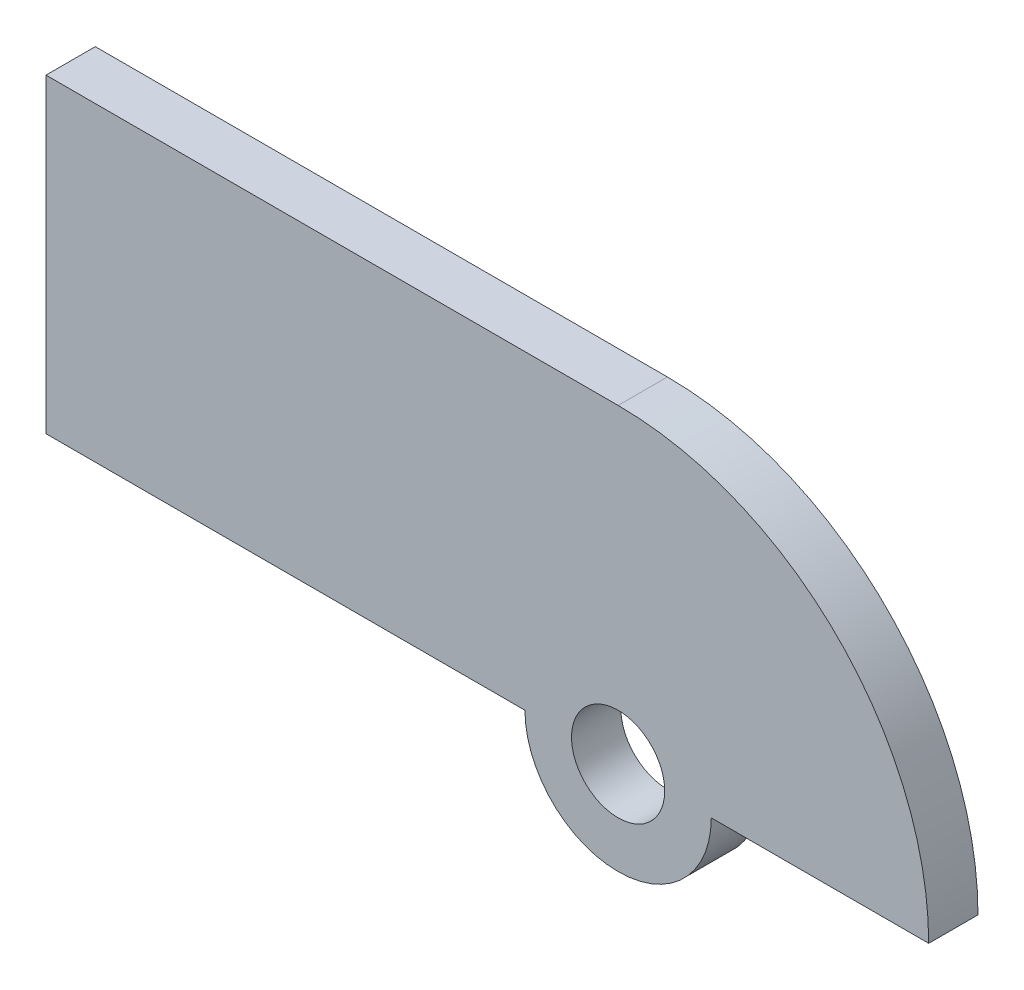
ISO-10303-21;
HEADER;
FILE_DESCRIPTION(('STEP AP214'),'2;1');
FILE_NAME('part.step','',(''),(''),'','','');
FILE_SCHEMA(('AUTOMOTIVE_DESIGN { 1 0 10303 214 1 1 1 1 }'));
ENDSEC;
DATA;
#1=APPLICATION_CONTEXT('core data for automotive mechanical design processes');
#2=APPLICATION_PROTOCOL_DEFINITION('international standard','automotive_design',2000,#1);
#3=PRODUCT_CONTEXT('',#1,'mechanical');
#4=PRODUCT('Part','Part','',(#3));
#5=PRODUCT_RELATED_PRODUCT_CATEGORY('part','',(#4));
#6=PRODUCT_DEFINITION_FORMATION('','',#4);
#7=PRODUCT_DEFINITION_CONTEXT('part definition',#1,'design');
#8=PRODUCT_DEFINITION('design','',#6,#7);
#9=PRODUCT_DEFINITION_SHAPE('','',#8);
#10=(LENGTH_UNIT() NAMED_UNIT(*) SI_UNIT(.MILLI.,.METRE.));
#11=(NAMED_UNIT(*) PLANE_ANGLE_UNIT() SI_UNIT($,.RADIAN.));
#12=(NAMED_UNIT(*) SI_UNIT($,.STERADIAN.) SOLID_ANGLE_UNIT());
#13=UNCERTAINTY_MEASURE_WITH_UNIT(LENGTH_MEASURE(1.E-05),#10,'distance_accuracy_value','');
#14=(GEOMETRIC_REPRESENTATION_CONTEXT(3) GLOBAL_UNCERTAINTY_ASSIGNED_CONTEXT((#13)) GLOBAL_UNIT_ASSIGNED_CONTEXT((#10,
#11,#12)) REPRESENTATION_CONTEXT('',''));
#15=CARTESIAN_POINT('',(0.,0.,0.));
#16=DIRECTION('',(0.,0.,1.));
#17=DIRECTION('',(1.,0.,0.));
#18=AXIS2_PLACEMENT_3D('',#15,#16,#17);
#19=CARTESIAN_POINT('',(0.,0.,3.175));
#20=DIRECTION('',(0.,0.,-1.));
#21=DIRECTION('',(-1.,0.,0.));
#22=AXIS2_PLACEMENT_3D('',#19,#20,#21);
#23=CYLINDRICAL_SURFACE('',#22,6.);
#24=CARTESIAN_POINT('',(0.,0.,0.));
#25=DIRECTION('',(0.,0.,1.));
#26=DIRECTION('',(1.,0.,0.));
#27=AXIS2_PLACEMENT_3D('',#24,#25,#26);
#28=CIRCLE('',#27,6.);
#29=CARTESIAN_POINT('',(-6.,0.,0.));
#30=VERTEX_POINT('',#29);
#31=CARTESIAN_POINT('',(6.,0.,0.));
#32=VERTEX_POINT('',#31);
#33=EDGE_CURVE('E136',#30,#32,#28,.T.);
#34=ORIENTED_EDGE('',*,*,#33,.T.);
#35=DIRECTION('',(0.,0.,-1.));
#36=VECTOR('',#35,1.);
#37=CARTESIAN_POINT('',(6.,0.,3.175));
#38=LINE('',#37,#36);
#39=CARTESIAN_POINT('',(6.,0.,3.175));
#40=VERTEX_POINT('',#39);
#41=EDGE_CURVE('E11',#40,#32,#38,.T.);
#42=ORIENTED_EDGE('',*,*,#41,.F.);
#43=CARTESIAN_POINT('',(0.,0.,3.175));
#44=DIRECTION('',(0.,0.,1.));
#45=DIRECTION('',(1.,0.,0.));
#46=AXIS2_PLACEMENT_3D('',#43,#44,#45);
#47=CIRCLE('',#46,6.);
#48=CARTESIAN_POINT('',(-6.,0.,3.175));
#49=VERTEX_POINT('',#48);
#50=EDGE_CURVE('E158',#49,#40,#47,.T.);
#51=ORIENTED_EDGE('',*,*,#50,.F.);
#52=DIRECTION('',(0.,0.,-1.));
#53=VECTOR('',#52,1.);
#54=CARTESIAN_POINT('',(-6.,0.,3.175));
#55=LINE('',#54,#53);
#56=EDGE_CURVE('E58',#49,#30,#55,.T.);
#57=ORIENTED_EDGE('',*,*,#56,.T.);
#58=EDGE_LOOP('',(#34,#42,#51,#57));
#59=FACE_BOUND('',#58,.T.);
#60=ADVANCED_FACE('F41',(#59),#23,.T.);
#61=CARTESIAN_POINT('',(0.,0.,3.175));
#62=DIRECTION('',(0.,1.,0.));
#63=DIRECTION('',(0.,0.,1.));
#64=AXIS2_PLACEMENT_3D('',#61,#62,#63);
#65=PLANE('',#64);
#66=DIRECTION('',(1.,0.,0.));
#67=VECTOR('',#66,1.);
#68=CARTESIAN_POINT('',(0.,0.,0.));
#69=LINE('',#68,#67);
#70=CARTESIAN_POINT('',(20.,0.,0.));
#71=VERTEX_POINT('',#70);
#72=EDGE_CURVE('E139',#32,#71,#69,.T.);
#73=ORIENTED_EDGE('',*,*,#72,.T.);
#74=DIRECTION('',(0.,0.,-1.));
#75=VECTOR('',#74,1.);
#76=CARTESIAN_POINT('',(20.,0.,3.175));
#77=LINE('',#76,#75);
#78=CARTESIAN_POINT('',(20.,0.,3.175));
#79=VERTEX_POINT('',#78);
#80=EDGE_CURVE('E50',#79,#71,#77,.T.);
#81=ORIENTED_EDGE('',*,*,#80,.F.);
#82=DIRECTION('',(1.,0.,0.));
#83=VECTOR('',#82,1.);
#84=CARTESIAN_POINT('',(0.,0.,3.175));
#85=LINE('',#84,#83);
#86=EDGE_CURVE('E90',#40,#79,#85,.T.);
#87=ORIENTED_EDGE('',*,*,#86,.F.);
#88=ORIENTED_EDGE('',*,*,#41,.T.);
#89=EDGE_LOOP('',(#73,#81,#87,#88));
#90=FACE_BOUND('',#89,.T.);
#91=ADVANCED_FACE('F184',(#90),#65,.F.);
#92=CARTESIAN_POINT('',(0.,0.,3.175));
#93=DIRECTION('',(0.,0.,-1.));
#94=DIRECTION('',(-1.,0.,0.));
#95=AXIS2_PLACEMENT_3D('',#92,#93,#94);
#96=CYLINDRICAL_SURFACE('',#95,20.);
#97=CARTESIAN_POINT('',(0.,0.,0.));
#98=DIRECTION('',(0.,0.,1.));
#99=DIRECTION('',(1.,0.,0.));
#100=AXIS2_PLACEMENT_3D('',#97,#98,#99);
#101=CIRCLE('',#100,20.);
#102=CARTESIAN_POINT('',(0.,20.,0.));
#103=VERTEX_POINT('',#102);
#104=EDGE_CURVE('E142',#71,#103,#101,.T.);
#105=ORIENTED_EDGE('',*,*,#104,.T.);
#106=DIRECTION('',(0.,0.,-1.));
#107=VECTOR('',#106,1.);
#108=CARTESIAN_POINT('',(0.,20.,3.175));
#109=LINE('',#108,#107);
#110=CARTESIAN_POINT('',(0.,20.,3.175));
#111=VERTEX_POINT('',#110);
#112=EDGE_CURVE('E122',#111,#103,#109,.T.);
#113=ORIENTED_EDGE('',*,*,#112,.F.);
#114=CARTESIAN_POINT('',(0.,0.,3.175));
#115=DIRECTION('',(0.,0.,1.));
#116=DIRECTION('',(1.,0.,0.));
#117=AXIS2_PLACEMENT_3D('',#114,#115,#116);
#118=CIRCLE('',#117,20.);
#119=EDGE_CURVE('E108',#79,#111,#118,.T.);
#120=ORIENTED_EDGE('',*,*,#119,.F.);
#121=ORIENTED_EDGE('',*,*,#80,.T.);
#122=EDGE_LOOP('',(#105,#113,#120,#121));
#123=FACE_BOUND('',#122,.T.);
#124=ADVANCED_FACE('F168',(#123),#96,.T.);
#125=CARTESIAN_POINT('',(0.,20.,3.175));
#126=DIRECTION('',(0.,-1.,0.));
#127=DIRECTION('',(1.,0.,0.));
#128=AXIS2_PLACEMENT_3D('',#125,#126,#127);
#129=PLANE('',#128);
#130=DIRECTION('',(-1.,0.,0.));
#131=VECTOR('',#130,1.);
#132=CARTESIAN_POINT('',(0.,20.,0.));
#133=LINE('',#132,#131);
#134=CARTESIAN_POINT('',(-36.8421352501216,20.,0.));
#135=VERTEX_POINT('',#134);
#136=EDGE_CURVE('E118',#103,#135,#133,.T.);
#137=ORIENTED_EDGE('',*,*,#136,.T.);
#138=DIRECTION('',(0.,0.,-1.));
#139=VECTOR('',#138,1.);
#140=CARTESIAN_POINT('',(-36.8421352501216,20.,3.175));
#141=LINE('',#140,#139);
#142=CARTESIAN_POINT('',(-36.8421352501216,20.,3.175));
#143=VERTEX_POINT('',#142);
#144=EDGE_CURVE('E115',#143,#135,#141,.T.);
#145=ORIENTED_EDGE('',*,*,#144,.F.);
#146=DIRECTION('',(-1.,0.,0.));
#147=VECTOR('',#146,1.);
#148=CARTESIAN_POINT('',(0.,20.,3.175));
#149=LINE('',#148,#147);
#150=EDGE_CURVE('E100',#111,#143,#149,.T.);
#151=ORIENTED_EDGE('',*,*,#150,.F.);
#152=ORIENTED_EDGE('',*,*,#112,.T.);
#153=EDGE_LOOP('',(#137,#145,#151,#152));
#154=FACE_BOUND('',#153,.T.);
#155=ADVANCED_FACE('F116',(#154),#129,.F.);
#156=CARTESIAN_POINT('',(-36.8421352501216,0.,3.175));
#157=DIRECTION('',(-1.,0.,0.));
#158=DIRECTION('',(0.,0.,1.));
#159=AXIS2_PLACEMENT_3D('',#156,#157,#158);
#160=PLANE('',#159);
#161=DIRECTION('',(0.,1.,0.));
#162=VECTOR('',#161,1.);
#163=CARTESIAN_POINT('',(-36.8421352501216,0.,0.));
#164=LINE('',#163,#162);
#165=CARTESIAN_POINT('',(-36.8421352501216,0.,0.));
#166=VERTEX_POINT('',#165);
#167=EDGE_CURVE('E147',#166,#135,#164,.T.);
#168=ORIENTED_EDGE('',*,*,#167,.F.);
#169=DIRECTION('',(0.,0.,-1.));
#170=VECTOR('',#169,1.);
#171=CARTESIAN_POINT('',(-36.8421352501216,0.,3.175));
#172=LINE('',#171,#170);
#173=CARTESIAN_POINT('',(-36.8421352501216,0.,3.175));
#174=VERTEX_POINT('',#173);
#175=EDGE_CURVE('E78',#174,#166,#172,.T.);
#176=ORIENTED_EDGE('',*,*,#175,.F.);
#177=DIRECTION('',(0.,1.,0.));
#178=VECTOR('',#177,1.);
#179=CARTESIAN_POINT('',(-36.8421352501216,0.,3.175));
#180=LINE('',#179,#178);
#181=EDGE_CURVE('E106',#174,#143,#180,.T.);
#182=ORIENTED_EDGE('',*,*,#181,.T.);
#183=ORIENTED_EDGE('',*,*,#144,.T.);
#184=EDGE_LOOP('',(#168,#176,#182,#183));
#185=FACE_BOUND('',#184,.T.);
#186=ADVANCED_FACE('F124',(#185),#160,.T.);
#187=CARTESIAN_POINT('',(0.,0.,3.175));
#188=DIRECTION('',(0.,-1.,0.));
#189=DIRECTION('',(0.,0.,-1.));
#190=AXIS2_PLACEMENT_3D('',#187,#188,#189);
#191=PLANE('',#190);
#192=DIRECTION('',(-1.,0.,0.));
#193=VECTOR('',#192,1.);
#194=CARTESIAN_POINT('',(0.,0.,0.));
#195=LINE('',#194,#193);
#196=EDGE_CURVE('E150',#30,#166,#195,.T.);
#197=ORIENTED_EDGE('',*,*,#196,.F.);
#198=ORIENTED_EDGE('',*,*,#56,.F.);
#199=DIRECTION('',(-1.,0.,0.));
#200=VECTOR('',#199,1.);
#201=CARTESIAN_POINT('',(0.,0.,3.175));
#202=LINE('',#201,#200);
#203=EDGE_CURVE('E126',#49,#174,#202,.T.);
#204=ORIENTED_EDGE('',*,*,#203,.T.);
#205=ORIENTED_EDGE('',*,*,#175,.T.);
#206=EDGE_LOOP('',(#197,#198,#204,#205));
#207=FACE_BOUND('',#206,.T.);
#208=ADVANCED_FACE('F172',(#207),#191,.T.);
#209=CARTESIAN_POINT('',(0.,0.,3.175));
#210=DIRECTION('',(0.,0.,-1.));
#211=DIRECTION('',(-1.,0.,0.));
#212=AXIS2_PLACEMENT_3D('',#209,#210,#211);
#213=CYLINDRICAL_SURFACE('',#212,3.);
#214=CARTESIAN_POINT('',(0.,0.,3.175));
#215=DIRECTION('',(0.,0.,1.));
#216=DIRECTION('',(1.,0.,0.));
#217=AXIS2_PLACEMENT_3D('',#214,#215,#216);
#218=CIRCLE('',#217,3.);
#219=CARTESIAN_POINT('',(3.,0.,3.175));
#220=VERTEX_POINT('',#219);
#221=EDGE_CURVE('E129',#220,#220,#218,.T.);
#222=ORIENTED_EDGE('',*,*,#221,.T.);
#223=EDGE_LOOP('',(#222));
#224=FACE_BOUND('',#223,.T.);
#225=CARTESIAN_POINT('',(0.,0.,0.));
#226=DIRECTION('',(0.,0.,1.));
#227=DIRECTION('',(1.,0.,0.));
#228=AXIS2_PLACEMENT_3D('',#225,#226,#227);
#229=CIRCLE('',#228,3.);
#230=CARTESIAN_POINT('',(3.,0.,0.));
#231=VERTEX_POINT('',#230);
#232=EDGE_CURVE('E154',#231,#231,#229,.T.);
#233=ORIENTED_EDGE('',*,*,#232,.F.);
#234=EDGE_LOOP('',(#233));
#235=FACE_BOUND('',#234,.T.);
#236=ADVANCED_FACE('F174',(#224,#235),#213,.F.);
#237=CARTESIAN_POINT('',(0.,0.,3.175));
#238=DIRECTION('',(0.,0.,1.));
#239=DIRECTION('',(1.,0.,0.));
#240=AXIS2_PLACEMENT_3D('',#237,#238,#239);
#241=PLANE('',#240);
#242=ORIENTED_EDGE('',*,*,#50,.T.);
#243=ORIENTED_EDGE('',*,*,#86,.T.);
#244=ORIENTED_EDGE('',*,*,#119,.T.);
#245=ORIENTED_EDGE('',*,*,#150,.T.);
#246=ORIENTED_EDGE('',*,*,#181,.F.);
#247=ORIENTED_EDGE('',*,*,#203,.F.);
#248=EDGE_LOOP('',(#242,#243,#244,#245,#246,#247));
#249=FACE_BOUND('',#248,.T.);
#250=ORIENTED_EDGE('',*,*,#221,.F.);
#251=EDGE_LOOP('',(#250));
#252=FACE_BOUND('',#251,.T.);
#253=ADVANCED_FACE('F102',(#249,#252),#241,.T.);
#254=CARTESIAN_POINT('',(0.,0.,0.));
#255=DIRECTION('',(0.,0.,1.));
#256=DIRECTION('',(1.,0.,0.));
#257=AXIS2_PLACEMENT_3D('',#254,#255,#256);
#258=PLANE('',#257);
#259=ORIENTED_EDGE('',*,*,#33,.F.);
#260=ORIENTED_EDGE('',*,*,#196,.T.);
#261=ORIENTED_EDGE('',*,*,#167,.T.);
#262=ORIENTED_EDGE('',*,*,#136,.F.);
#263=ORIENTED_EDGE('',*,*,#104,.F.);
#264=ORIENTED_EDGE('',*,*,#72,.F.);
#265=EDGE_LOOP('',(#259,#260,#261,#262,#263,#264));
#266=FACE_BOUND('',#265,.T.);
#267=ORIENTED_EDGE('',*,*,#232,.T.);
#268=EDGE_LOOP('',(#267));
#269=FACE_BOUND('',#268,.T.);
#270=ADVANCED_FACE('F170',(#266,#269),#258,.F.);
#271=CLOSED_SHELL('',(#60,#91,#124,#155,#186,#208,#236,#253,#270));
#272=MANIFOLD_SOLID_BREP('B2',#271);
#273=ADVANCED_BREP_SHAPE_REPRESENTATION('',(#18,#272),#14);
#274=SHAPE_DEFINITION_REPRESENTATION(#9,#273);
ENDSEC;
END-ISO-10303-21;
